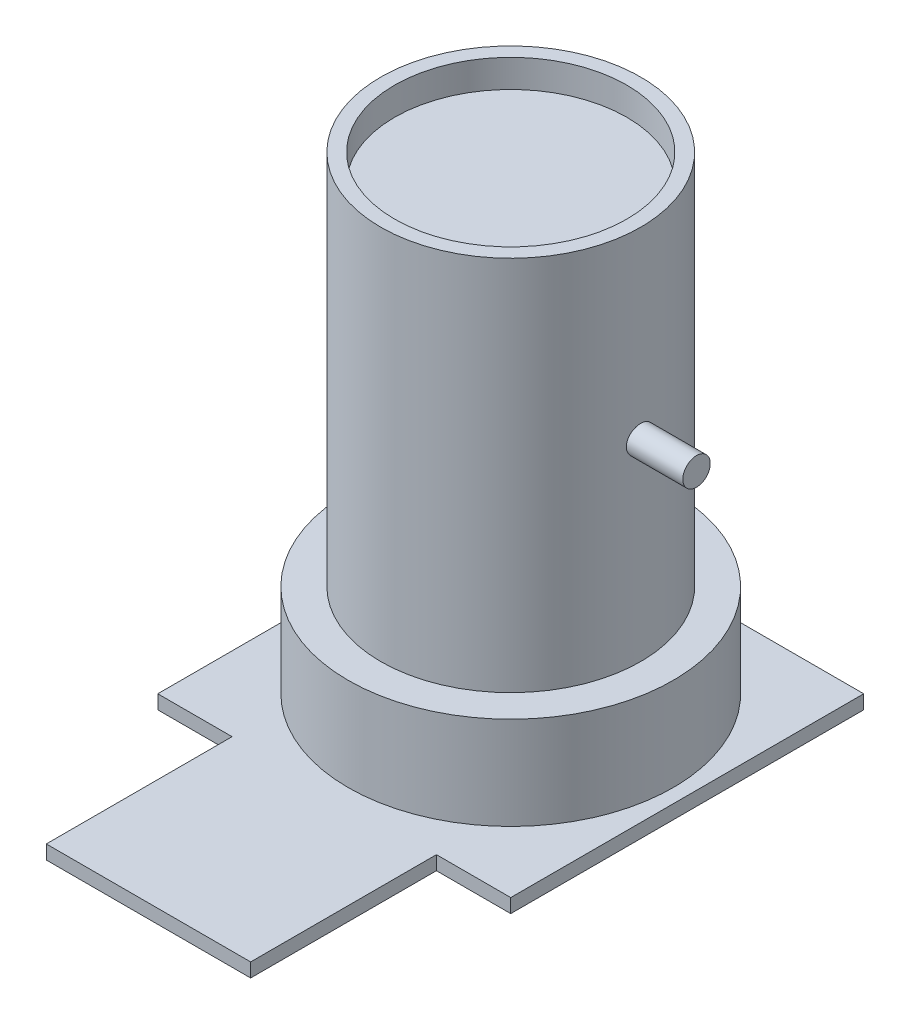
ISO-10303-21;
HEADER;
FILE_DESCRIPTION(('STEP AP214'),'2;1');
FILE_NAME('part.step','',(''),(''),'','','');
FILE_SCHEMA(('AUTOMOTIVE_DESIGN { 1 0 10303 214 1 1 1 1 }'));
ENDSEC;
DATA;
#1=APPLICATION_CONTEXT('core data for automotive mechanical design processes');
#2=APPLICATION_PROTOCOL_DEFINITION('international standard','automotive_design',2000,#1);
#3=PRODUCT_CONTEXT('',#1,'mechanical');
#4=PRODUCT('Part','Part','',(#3));
#5=PRODUCT_RELATED_PRODUCT_CATEGORY('part','',(#4));
#6=PRODUCT_DEFINITION_FORMATION('','',#4);
#7=PRODUCT_DEFINITION_CONTEXT('part definition',#1,'design');
#8=PRODUCT_DEFINITION('design','',#6,#7);
#9=PRODUCT_DEFINITION_SHAPE('','',#8);
#10=(LENGTH_UNIT() NAMED_UNIT(*) SI_UNIT(.MILLI.,.METRE.));
#11=(NAMED_UNIT(*) PLANE_ANGLE_UNIT() SI_UNIT($,.RADIAN.));
#12=(NAMED_UNIT(*) SI_UNIT($,.STERADIAN.) SOLID_ANGLE_UNIT());
#13=UNCERTAINTY_MEASURE_WITH_UNIT(LENGTH_MEASURE(1.E-05),#10,'distance_accuracy_value','');
#14=(GEOMETRIC_REPRESENTATION_CONTEXT(3) GLOBAL_UNCERTAINTY_ASSIGNED_CONTEXT((#13)) GLOBAL_UNIT_ASSIGNED_CONTEXT((#10,
#11,#12)) REPRESENTATION_CONTEXT('',''));
#15=CARTESIAN_POINT('',(0.,0.,0.));
#16=DIRECTION('',(0.,0.,1.));
#17=DIRECTION('',(1.,0.,0.));
#18=AXIS2_PLACEMENT_3D('',#15,#16,#17);
#19=CARTESIAN_POINT('',(-19.,1.5,19.));
#20=DIRECTION('',(0.,0.,-1.));
#21=DIRECTION('',(-1.,0.,0.));
#22=AXIS2_PLACEMENT_3D('',#19,#20,#21);
#23=PLANE('',#22);
#24=DIRECTION('',(0.,1.,0.));
#25=VECTOR('',#24,1.);
#26=CARTESIAN_POINT('',(11.,0.,19.));
#27=LINE('',#26,#25);
#28=CARTESIAN_POINT('',(11.,0.,19.));
#29=VERTEX_POINT('',#28);
#30=CARTESIAN_POINT('',(11.,1.5,19.));
#31=VERTEX_POINT('',#30);
#32=EDGE_CURVE('E128',#29,#31,#27,.T.);
#33=ORIENTED_EDGE('',*,*,#32,.F.);
#34=DIRECTION('',(1.,0.,0.));
#35=VECTOR('',#34,1.);
#36=CARTESIAN_POINT('',(-19.,0.,19.));
#37=LINE('',#36,#35);
#38=CARTESIAN_POINT('',(19.,0.,19.));
#39=VERTEX_POINT('',#38);
#40=EDGE_CURVE('E171',#29,#39,#37,.T.);
#41=ORIENTED_EDGE('',*,*,#40,.T.);
#42=DIRECTION('',(0.,-1.,0.));
#43=VECTOR('',#42,1.);
#44=CARTESIAN_POINT('',(19.,1.5,19.));
#45=LINE('',#44,#43);
#46=CARTESIAN_POINT('',(19.,1.5,19.));
#47=VERTEX_POINT('',#46);
#48=EDGE_CURVE('E182',#47,#39,#45,.T.);
#49=ORIENTED_EDGE('',*,*,#48,.F.);
#50=DIRECTION('',(1.,0.,0.));
#51=VECTOR('',#50,1.);
#52=CARTESIAN_POINT('',(-19.,1.5,19.));
#53=LINE('',#52,#51);
#54=EDGE_CURVE('E59',#31,#47,#53,.T.);
#55=ORIENTED_EDGE('',*,*,#54,.F.);
#56=EDGE_LOOP('',(#33,#41,#49,#55));
#57=FACE_BOUND('',#56,.T.);
#58=ADVANCED_FACE('F39',(#57),#23,.F.);
#59=DIRECTION('',(0.,-1.,0.));
#60=VECTOR('',#59,1.);
#61=CARTESIAN_POINT('',(-11.,1.5,19.));
#62=LINE('',#61,#60);
#63=CARTESIAN_POINT('',(-11.,1.5,19.));
#64=VERTEX_POINT('',#63);
#65=CARTESIAN_POINT('',(-11.,0.,19.));
#66=VERTEX_POINT('',#65);
#67=EDGE_CURVE('E67',#64,#66,#62,.T.);
#68=ORIENTED_EDGE('',*,*,#67,.F.);
#69=CARTESIAN_POINT('',(-19.,1.5,19.));
#70=VERTEX_POINT('',#69);
#71=EDGE_CURVE('E132',#70,#64,#53,.T.);
#72=ORIENTED_EDGE('',*,*,#71,.F.);
#73=DIRECTION('',(0.,-1.,0.));
#74=VECTOR('',#73,1.);
#75=CARTESIAN_POINT('',(-19.,1.5,19.));
#76=LINE('',#75,#74);
#77=CARTESIAN_POINT('',(-19.,0.,19.));
#78=VERTEX_POINT('',#77);
#79=EDGE_CURVE('E159',#70,#78,#76,.T.);
#80=ORIENTED_EDGE('',*,*,#79,.T.);
#81=EDGE_CURVE('E172',#78,#66,#37,.T.);
#82=ORIENTED_EDGE('',*,*,#81,.T.);
#83=EDGE_LOOP('',(#68,#72,#80,#82));
#84=FACE_BOUND('',#83,.T.);
#85=ADVANCED_FACE('F186',(#84),#23,.F.);
#86=CARTESIAN_POINT('',(0.,52.,0.));
#87=DIRECTION('',(0.,-1.,0.));
#88=DIRECTION('',(0.,0.,-1.));
#89=AXIS2_PLACEMENT_3D('',#86,#87,#88);
#90=CYLINDRICAL_SURFACE('',#89,14.);
#91=CARTESIAN_POINT('',(0.,52.,0.));
#92=DIRECTION('',(0.,1.,0.));
#93=DIRECTION('',(0.,0.,1.));
#94=AXIS2_PLACEMENT_3D('',#91,#92,#93);
#95=CIRCLE('',#94,14.);
#96=CARTESIAN_POINT('',(0.,52.,14.));
#97=VERTEX_POINT('',#96);
#98=EDGE_CURVE('E145',#97,#97,#95,.T.);
#99=ORIENTED_EDGE('',*,*,#98,.F.);
#100=EDGE_LOOP('',(#99));
#101=FACE_BOUND('',#100,.T.);
#102=CARTESIAN_POINT('',(0.,11.5,0.));
#103=DIRECTION('',(0.,1.,0.));
#104=DIRECTION('',(0.,0.,1.));
#105=AXIS2_PLACEMENT_3D('',#102,#103,#104);
#106=CIRCLE('',#105,14.);
#107=CARTESIAN_POINT('',(0.,11.5,14.));
#108=VERTEX_POINT('',#107);
#109=EDGE_CURVE('E52',#108,#108,#106,.T.);
#110=ORIENTED_EDGE('',*,*,#109,.T.);
#111=EDGE_LOOP('',(#110));
#112=FACE_BOUND('',#111,.T.);
#113=CARTESIAN_POINT('',(13.9217008769303,32.23,1.47859551374899));
#114=CARTESIAN_POINT('',(13.9217018985333,32.1471955140011,1.47859193940249));
#115=CARTESIAN_POINT('',(13.9224476075702,32.0643368916052,1.4716162374133));
#116=CARTESIAN_POINT('',(13.9253493119721,31.9009187118346,1.44389517206571));
#117=CARTESIAN_POINT('',(13.9275068449657,31.8203617611778,1.42313479534767));
#118=CARTESIAN_POINT('',(13.9329851479591,31.6639370236322,1.36845720880594));
#119=CARTESIAN_POINT('',(13.9363051953401,31.588066358135,1.33454817078543));
#120=CARTESIAN_POINT('',(13.9437335564317,31.4431091007587,1.25455190521855));
#121=CARTESIAN_POINT('',(13.9478417180394,31.3740212037164,1.20846702691307));
#122=CARTESIAN_POINT('',(13.9564020053146,31.2442956930374,1.10522746584132));
#123=CARTESIAN_POINT('',(13.9608553145534,31.1836893543187,1.04803357882295));
#124=CARTESIAN_POINT('',(13.9695934011982,31.0729168471415,0.924283470158432));
#125=CARTESIAN_POINT('',(13.9738781707509,31.022751164713,0.857726812901252));
#126=CARTESIAN_POINT('',(13.9818081976128,30.9341748963009,0.716947650328693));
#127=CARTESIAN_POINT('',(13.9854519322873,30.8957921412732,0.642707541101972));
#128=CARTESIAN_POINT('',(13.9916764280569,30.8320493599285,0.488790894859693));
#129=CARTESIAN_POINT('',(13.9942572178311,30.8066889822521,0.409114504587226));
#130=CARTESIAN_POINT('',(13.9980567239599,30.7698029860691,0.246904018121317));
#131=CARTESIAN_POINT('',(13.999280512265,30.7582258390939,0.164381759977712));
#132=CARTESIAN_POINT('',(14.000245393181,30.7490754457037,-0.00144290525880824));
#133=CARTESIAN_POINT('',(13.9999865283288,30.7515017975313,-0.0847452899016081));
#134=CARTESIAN_POINT('',(13.998019411168,30.7702478080579,-0.249415598561515));
#135=CARTESIAN_POINT('',(13.9963169394906,30.786512056579,-0.330789909166303));
#136=CARTESIAN_POINT('',(13.9916605266013,30.8323857955469,-0.489647387931168));
#137=CARTESIAN_POINT('',(13.9887065675378,30.8619954763584,-0.567130500568084));
#138=CARTESIAN_POINT('',(13.9818692906832,30.9337799470774,-0.716180142049843));
#139=CARTESIAN_POINT('',(13.9779841704686,30.9759791454358,-0.78773482939633));
#140=CARTESIAN_POINT('',(13.9697202552734,31.0717270419416,-0.922767241554956));
#141=CARTESIAN_POINT('',(13.9653414441348,31.12527611161,-0.986244701862365));
#142=CARTESIAN_POINT('',(13.9565560383355,31.2425150566284,-1.10364551962732));
#143=CARTESIAN_POINT('',(13.9521494123836,31.3062531526523,-1.157520732097));
#144=CARTESIAN_POINT('',(13.9438263087167,31.4418939917819,-1.25381470164222));
#145=CARTESIAN_POINT('',(13.9399098318543,31.5137967490896,-1.29623343878943));
#146=CARTESIAN_POINT('',(13.9330102070991,31.6637640641068,-1.36841072235792));
#147=CARTESIAN_POINT('',(13.9300272918413,31.7418301516029,-1.39816611385224));
#148=CARTESIAN_POINT('',(13.9253372837148,31.9018890149424,-1.44413302137016));
#149=CARTESIAN_POINT('',(13.923630147383,31.9838816569148,-1.46034499879226));
#150=CARTESIAN_POINT('',(13.9216926079778,32.1490429748327,-1.47870257419887));
#151=CARTESIAN_POINT('',(13.9214551253006,32.2322040755093,-1.48091560892356));
#152=CARTESIAN_POINT('',(13.9224650919054,32.3977130281326,-1.47138975316376));
#153=CARTESIAN_POINT('',(13.923712518761,32.4800608923427,-1.45965107339046));
#154=CARTESIAN_POINT('',(13.9275453067833,32.6414081191883,-1.42261150248023));
#155=CARTESIAN_POINT('',(13.9301275062476,32.7204149195407,-1.39734265546863));
#156=CARTESIAN_POINT('',(13.9363363273414,32.8730688048298,-1.33399280904767));
#157=CARTESIAN_POINT('',(13.9399629755594,32.9467157532606,-1.29591148346587));
#158=CARTESIAN_POINT('',(13.9478691653757,33.0868662815459,-1.20784937795188));
#159=CARTESIAN_POINT('',(13.9521511315215,33.1533417033728,-1.15782400570731));
#160=CARTESIAN_POINT('',(13.9608776219888,33.2769762819127,-1.04735757638407));
#161=CARTESIAN_POINT('',(13.9653221508002,33.3341351810633,-0.986916231442819));
#162=CARTESIAN_POINT('',(13.9738944318918,33.4377476302954,-0.857040586998218));
#163=CARTESIAN_POINT('',(13.9780208357538,33.4841571213642,-0.787571036541403));
#164=CARTESIAN_POINT('',(13.9854721985383,33.5646498334921,-0.64178452580534));
#165=CARTESIAN_POINT('',(13.9887971695356,33.5987332402651,-0.565467668714376));
#166=CARTESIAN_POINT('',(13.9942649663394,33.6535320151324,-0.408305171643969));
#167=CARTESIAN_POINT('',(13.996410123193,33.6742737572059,-0.327468812043141));
#168=CARTESIAN_POINT('',(13.9992861806915,33.701886442769,-0.163436943909355));
#169=CARTESIAN_POINT('',(14.000017125999,33.7087578243036,-0.0802415099633438));
#170=CARTESIAN_POINT('',(13.9999823418746,33.7084281655288,0.0857146703553778));
#171=CARTESIAN_POINT('',(13.9992238765688,33.7012954258923,0.168475562368818));
#172=CARTESIAN_POINT('',(13.9963098424257,33.6733035146444,0.331616218145153));
#173=CARTESIAN_POINT('',(13.9941542728547,33.6524443358244,0.411995980657554));
#174=CARTESIAN_POINT('',(13.9886874466702,33.597611125071,0.568090392235254));
#175=CARTESIAN_POINT('',(13.9853763899462,33.563639361397,0.64380584552323));
#176=CARTESIAN_POINT('',(13.9779671692675,33.4835525102341,0.788471010563124));
#177=CARTESIAN_POINT('',(13.9738690070023,33.437437448812,0.857420736837956));
#178=CARTESIAN_POINT('',(13.9653204471035,33.3341174639087,0.986947125080946));
#179=CARTESIAN_POINT('',(13.96086849095,33.2768616560894,1.04748309617783));
#180=CARTESIAN_POINT('',(13.9521271696985,33.1529874548082,1.15811733303848));
#181=CARTESIAN_POINT('',(13.9478378437544,33.0863668246708,1.20821309816758));
#182=CARTESIAN_POINT('',(13.9398945787594,32.9454469236806,1.296658232284));
#183=CARTESIAN_POINT('',(13.9362424556348,32.8711266393256,1.3349742599775));
#184=CARTESIAN_POINT('',(13.9300086305885,32.7171146306921,1.39853089550581));
#185=CARTESIAN_POINT('',(13.9274257307745,32.6374290344321,1.42378614379081));
#186=CARTESIAN_POINT('',(13.9242692380361,32.5027498604284,1.45425767524857));
#187=CARTESIAN_POINT('',(13.9233107063122,32.4486151435146,1.46337176006621));
#188=CARTESIAN_POINT('',(13.9220261889744,32.3396615313724,1.47554184836805));
#189=CARTESIAN_POINT('',(13.9217002003074,32.2848426394476,1.4785978810917));
#190=CARTESIAN_POINT('',(13.9217008769303,32.23,1.47859551374899));
#191=B_SPLINE_CURVE_WITH_KNOTS('',3,(#113,#114,#115,#116,#117,#118,#119,#120,#121,#122,#123,
#124,#125,#126,#127,#128,#129,#130,#131,#132,#133,#134,#135,#136,#137,#138,#139,#140,#141,#142,
#143,#144,#145,#146,#147,#148,#149,#150,#151,#152,#153,#154,#155,#156,#157,#158,#159,#160,#161,
#162,#163,#164,#165,#166,#167,#168,#169,#170,#171,#172,#173,#174,#175,#176,#177,#178,#179,#180,
#181,#182,#183,#184,#185,#186,#187,#188,#189,#190),.UNSPECIFIED.,.T.,.F.,(4,2,2,2,2,2,2,2,2,2,2,
2,2,2,2,2,2,2,2,2,2,2,2,2,2,2,2,2,2,2,2,2,2,2,2,2,2,2,4),(0.,0.24821316798498,0.496697117806667,
0.74502688343023,0.993308770556095,1.2424833214035,1.49166946914996,1.74143973796592,
1.99120326732686,2.24003009646647,2.48884978685416,2.73667780882406,2.98450936602609,
3.23282457456578,3.48114791258522,3.73068329520707,3.98021911188831,4.22981706120632,
4.47940650684763,4.72779269030607,4.97617512246302,5.22397188413062,5.47177495453797,
5.72051806049395,5.96926804197887,6.21902022176484,6.46876863844027,6.71802181939899,
6.96726712847783,7.21529984179486,7.46333268536854,7.71132264259443,7.9593120674879,
8.20846193895971,8.45767141831351,8.70757989913342,8.95720763508596,9.12160369184957,
9.28599895514642),.UNSPECIFIED.);
#192=CARTESIAN_POINT('',(13.9217008769303,32.23,1.47859551374899));
#193=VERTEX_POINT('',#192);
#194=EDGE_CURVE('E11',#193,#193,#191,.T.);
#195=ORIENTED_EDGE('',*,*,#194,.F.);
#196=EDGE_LOOP('',(#195));
#197=FACE_BOUND('',#196,.T.);
#198=ADVANCED_FACE('F229',(#101,#112,#197),#90,.T.);
#199=CARTESIAN_POINT('',(-19.,1.5,-19.));
#200=DIRECTION('',(1.,0.,0.));
#201=DIRECTION('',(0.,0.,-1.));
#202=AXIS2_PLACEMENT_3D('',#199,#200,#201);
#203=PLANE('',#202);
#204=DIRECTION('',(0.,0.,1.));
#205=VECTOR('',#204,1.);
#206=CARTESIAN_POINT('',(-19.,0.,-19.));
#207=LINE('',#206,#205);
#208=CARTESIAN_POINT('',(-19.,0.,-19.));
#209=VERTEX_POINT('',#208);
#210=EDGE_CURVE('E156',#209,#78,#207,.T.);
#211=ORIENTED_EDGE('',*,*,#210,.T.);
#212=ORIENTED_EDGE('',*,*,#79,.F.);
#213=DIRECTION('',(0.,0.,1.));
#214=VECTOR('',#213,1.);
#215=CARTESIAN_POINT('',(-19.,1.5,-19.));
#216=LINE('',#215,#214);
#217=CARTESIAN_POINT('',(-19.,1.5,-19.));
#218=VERTEX_POINT('',#217);
#219=EDGE_CURVE('E160',#218,#70,#216,.T.);
#220=ORIENTED_EDGE('',*,*,#219,.F.);
#221=DIRECTION('',(0.,-1.,0.));
#222=VECTOR('',#221,1.);
#223=CARTESIAN_POINT('',(-19.,1.5,-19.));
#224=LINE('',#223,#222);
#225=EDGE_CURVE('E168',#218,#209,#224,.T.);
#226=ORIENTED_EDGE('',*,*,#225,.T.);
#227=EDGE_LOOP('',(#211,#212,#220,#226));
#228=FACE_BOUND('',#227,.T.);
#229=ADVANCED_FACE('F41',(#228),#203,.F.);
#230=CARTESIAN_POINT('',(19.,1.5,-19.));
#231=DIRECTION('',(-1.,0.,0.));
#232=DIRECTION('',(0.,0.,1.));
#233=AXIS2_PLACEMENT_3D('',#230,#231,#232);
#234=PLANE('',#233);
#235=DIRECTION('',(0.,0.,-1.));
#236=VECTOR('',#235,1.);
#237=CARTESIAN_POINT('',(19.,0.,-19.));
#238=LINE('',#237,#236);
#239=CARTESIAN_POINT('',(19.,0.,-19.));
#240=VERTEX_POINT('',#239);
#241=EDGE_CURVE('E174',#39,#240,#238,.T.);
#242=ORIENTED_EDGE('',*,*,#241,.T.);
#243=DIRECTION('',(0.,-1.,0.));
#244=VECTOR('',#243,1.);
#245=CARTESIAN_POINT('',(19.,1.5,-19.));
#246=LINE('',#245,#244);
#247=CARTESIAN_POINT('',(19.,1.5,-19.));
#248=VERTEX_POINT('',#247);
#249=EDGE_CURVE('E179',#248,#240,#246,.T.);
#250=ORIENTED_EDGE('',*,*,#249,.F.);
#251=DIRECTION('',(0.,0.,-1.));
#252=VECTOR('',#251,1.);
#253=CARTESIAN_POINT('',(19.,1.5,-19.));
#254=LINE('',#253,#252);
#255=EDGE_CURVE('E164',#47,#248,#254,.T.);
#256=ORIENTED_EDGE('',*,*,#255,.F.);
#257=ORIENTED_EDGE('',*,*,#48,.T.);
#258=EDGE_LOOP('',(#242,#250,#256,#257));
#259=FACE_BOUND('',#258,.T.);
#260=ADVANCED_FACE('F209',(#259),#234,.F.);
#261=CARTESIAN_POINT('',(-19.,1.5,-19.));
#262=DIRECTION('',(0.,0.,1.));
#263=DIRECTION('',(1.,0.,0.));
#264=AXIS2_PLACEMENT_3D('',#261,#262,#263);
#265=PLANE('',#264);
#266=DIRECTION('',(-1.,0.,0.));
#267=VECTOR('',#266,1.);
#268=CARTESIAN_POINT('',(-19.,0.,-19.));
#269=LINE('',#268,#267);
#270=EDGE_CURVE('E162',#240,#209,#269,.T.);
#271=ORIENTED_EDGE('',*,*,#270,.T.);
#272=ORIENTED_EDGE('',*,*,#225,.F.);
#273=DIRECTION('',(-1.,0.,0.));
#274=VECTOR('',#273,1.);
#275=CARTESIAN_POINT('',(-19.,1.5,-19.));
#276=LINE('',#275,#274);
#277=EDGE_CURVE('E166',#248,#218,#276,.T.);
#278=ORIENTED_EDGE('',*,*,#277,.F.);
#279=ORIENTED_EDGE('',*,*,#249,.T.);
#280=EDGE_LOOP('',(#271,#272,#278,#279));
#281=FACE_BOUND('',#280,.T.);
#282=ADVANCED_FACE('F212',(#281),#265,.F.);
#283=CARTESIAN_POINT('',(0.,1.5,0.));
#284=DIRECTION('',(0.,1.,0.));
#285=DIRECTION('',(0.,0.,1.));
#286=AXIS2_PLACEMENT_3D('',#283,#284,#285);
#287=PLANE('',#286);
#288=CARTESIAN_POINT('',(0.,1.5,0.));
#289=DIRECTION('',(0.,1.,0.));
#290=DIRECTION('',(0.,0.,1.));
#291=AXIS2_PLACEMENT_3D('',#288,#289,#290);
#292=CIRCLE('',#291,17.5);
#293=CARTESIAN_POINT('',(0.,1.5,17.5));
#294=VERTEX_POINT('',#293);
#295=EDGE_CURVE('E153',#294,#294,#292,.T.);
#296=ORIENTED_EDGE('',*,*,#295,.F.);
#297=EDGE_LOOP('',(#296));
#298=FACE_BOUND('',#297,.T.);
#299=ORIENTED_EDGE('',*,*,#219,.T.);
#300=ORIENTED_EDGE('',*,*,#71,.T.);
#301=DIRECTION('',(0.,0.,-1.));
#302=VECTOR('',#301,1.);
#303=CARTESIAN_POINT('',(-11.,1.5,39.));
#304=LINE('',#303,#302);
#305=CARTESIAN_POINT('',(-11.,1.5,39.));
#306=VERTEX_POINT('',#305);
#307=EDGE_CURVE('E113',#306,#64,#304,.T.);
#308=ORIENTED_EDGE('',*,*,#307,.F.);
#309=DIRECTION('',(-1.,0.,0.));
#310=VECTOR('',#309,1.);
#311=CARTESIAN_POINT('',(11.,1.5,39.));
#312=LINE('',#311,#310);
#313=CARTESIAN_POINT('',(11.,1.5,39.));
#314=VERTEX_POINT('',#313);
#315=EDGE_CURVE('E119',#314,#306,#312,.T.);
#316=ORIENTED_EDGE('',*,*,#315,.F.);
#317=DIRECTION('',(0.,0.,-1.));
#318=VECTOR('',#317,1.);
#319=CARTESIAN_POINT('',(11.,1.5,39.));
#320=LINE('',#319,#318);
#321=EDGE_CURVE('E199',#314,#31,#320,.T.);
#322=ORIENTED_EDGE('',*,*,#321,.T.);
#323=ORIENTED_EDGE('',*,*,#54,.T.);
#324=ORIENTED_EDGE('',*,*,#255,.T.);
#325=ORIENTED_EDGE('',*,*,#277,.T.);
#326=EDGE_LOOP('',(#299,#300,#308,#316,#322,#323,#324,#325));
#327=FACE_BOUND('',#326,.T.);
#328=ADVANCED_FACE('F131',(#298,#327),#287,.T.);
#329=CARTESIAN_POINT('',(0.,0.,0.));
#330=DIRECTION('',(0.,1.,0.));
#331=DIRECTION('',(0.,0.,1.));
#332=AXIS2_PLACEMENT_3D('',#329,#330,#331);
#333=PLANE('',#332);
#334=ORIENTED_EDGE('',*,*,#210,.F.);
#335=ORIENTED_EDGE('',*,*,#270,.F.);
#336=ORIENTED_EDGE('',*,*,#241,.F.);
#337=ORIENTED_EDGE('',*,*,#40,.F.);
#338=DIRECTION('',(0.,0.,-1.));
#339=VECTOR('',#338,1.);
#340=CARTESIAN_POINT('',(11.,0.,39.));
#341=LINE('',#340,#339);
#342=CARTESIAN_POINT('',(11.,0.,39.));
#343=VERTEX_POINT('',#342);
#344=EDGE_CURVE('E138',#343,#29,#341,.T.);
#345=ORIENTED_EDGE('',*,*,#344,.F.);
#346=DIRECTION('',(1.,0.,0.));
#347=VECTOR('',#346,1.);
#348=CARTESIAN_POINT('',(-11.,0.,39.));
#349=LINE('',#348,#347);
#350=CARTESIAN_POINT('',(-11.,0.,39.));
#351=VERTEX_POINT('',#350);
#352=EDGE_CURVE('E118',#351,#343,#349,.T.);
#353=ORIENTED_EDGE('',*,*,#352,.F.);
#354=DIRECTION('',(0.,0.,-1.));
#355=VECTOR('',#354,1.);
#356=CARTESIAN_POINT('',(-11.,0.,39.));
#357=LINE('',#356,#355);
#358=EDGE_CURVE('E115',#351,#66,#357,.T.);
#359=ORIENTED_EDGE('',*,*,#358,.T.);
#360=ORIENTED_EDGE('',*,*,#81,.F.);
#361=EDGE_LOOP('',(#334,#335,#336,#337,#345,#353,#359,#360));
#362=FACE_BOUND('',#361,.T.);
#363=ADVANCED_FACE('F193',(#362),#333,.F.);
#364=CARTESIAN_POINT('',(0.,11.5,0.));
#365=DIRECTION('',(0.,-1.,0.));
#366=DIRECTION('',(0.,0.,-1.));
#367=AXIS2_PLACEMENT_3D('',#364,#365,#366);
#368=CYLINDRICAL_SURFACE('',#367,17.5);
#369=CARTESIAN_POINT('',(0.,11.5,0.));
#370=DIRECTION('',(0.,1.,0.));
#371=DIRECTION('',(0.,0.,1.));
#372=AXIS2_PLACEMENT_3D('',#369,#370,#371);
#373=CIRCLE('',#372,17.5);
#374=CARTESIAN_POINT('',(0.,11.5,17.5));
#375=VERTEX_POINT('',#374);
#376=EDGE_CURVE('E150',#375,#375,#373,.T.);
#377=ORIENTED_EDGE('',*,*,#376,.F.);
#378=EDGE_LOOP('',(#377));
#379=FACE_BOUND('',#378,.T.);
#380=ORIENTED_EDGE('',*,*,#295,.T.);
#381=EDGE_LOOP('',(#380));
#382=FACE_BOUND('',#381,.T.);
#383=ADVANCED_FACE('F249',(#379,#382),#368,.T.);
#384=CARTESIAN_POINT('',(0.,11.5,0.));
#385=DIRECTION('',(0.,1.,0.));
#386=DIRECTION('',(0.,0.,1.));
#387=AXIS2_PLACEMENT_3D('',#384,#385,#386);
#388=PLANE('',#387);
#389=ORIENTED_EDGE('',*,*,#109,.F.);
#390=EDGE_LOOP('',(#389));
#391=FACE_BOUND('',#390,.T.);
#392=ORIENTED_EDGE('',*,*,#376,.T.);
#393=EDGE_LOOP('',(#392));
#394=FACE_BOUND('',#393,.T.);
#395=ADVANCED_FACE('F246',(#391,#394),#388,.T.);
#396=CARTESIAN_POINT('',(0.,52.,0.));
#397=DIRECTION('',(0.,1.,0.));
#398=DIRECTION('',(0.,0.,1.));
#399=AXIS2_PLACEMENT_3D('',#396,#397,#398);
#400=PLANE('',#399);
#401=CARTESIAN_POINT('',(0.,52.,0.));
#402=DIRECTION('',(0.,1.,0.));
#403=DIRECTION('',(0.,0.,1.));
#404=AXIS2_PLACEMENT_3D('',#401,#402,#403);
#405=CIRCLE('',#404,12.5);
#406=CARTESIAN_POINT('',(0.,52.,12.5));
#407=VERTEX_POINT('',#406);
#408=EDGE_CURVE('E136',#407,#407,#405,.T.);
#409=ORIENTED_EDGE('',*,*,#408,.F.);
#410=EDGE_LOOP('',(#409));
#411=FACE_BOUND('',#410,.T.);
#412=ORIENTED_EDGE('',*,*,#98,.T.);
#413=EDGE_LOOP('',(#412));
#414=FACE_BOUND('',#413,.T.);
#415=ADVANCED_FACE('F244',(#411,#414),#400,.T.);
#416=CARTESIAN_POINT('',(0.,49.,0.));
#417=DIRECTION('',(0.,1.,0.));
#418=DIRECTION('',(0.,0.,1.));
#419=AXIS2_PLACEMENT_3D('',#416,#417,#418);
#420=CYLINDRICAL_SURFACE('',#419,12.5);
#421=CARTESIAN_POINT('',(0.,49.,0.));
#422=DIRECTION('',(0.,1.,0.));
#423=DIRECTION('',(0.,0.,1.));
#424=AXIS2_PLACEMENT_3D('',#421,#422,#423);
#425=CIRCLE('',#424,12.5);
#426=CARTESIAN_POINT('',(0.,49.,12.5));
#427=VERTEX_POINT('',#426);
#428=EDGE_CURVE('E142',#427,#427,#425,.T.);
#429=ORIENTED_EDGE('',*,*,#428,.F.);
#430=EDGE_LOOP('',(#429));
#431=FACE_BOUND('',#430,.T.);
#432=ORIENTED_EDGE('',*,*,#408,.T.);
#433=EDGE_LOOP('',(#432));
#434=FACE_BOUND('',#433,.T.);
#435=ADVANCED_FACE('F316',(#431,#434),#420,.F.);
#436=CARTESIAN_POINT('',(0.,49.,0.));
#437=DIRECTION('',(0.,1.,0.));
#438=DIRECTION('',(0.,0.,1.));
#439=AXIS2_PLACEMENT_3D('',#436,#437,#438);
#440=PLANE('',#439);
#441=ORIENTED_EDGE('',*,*,#428,.T.);
#442=EDGE_LOOP('',(#441));
#443=FACE_BOUND('',#442,.T.);
#444=ADVANCED_FACE('F304',(#443),#440,.T.);
#445=CARTESIAN_POINT('',(20.,32.23,0.));
#446=DIRECTION('',(-1.,0.,0.));
#447=DIRECTION('',(0.,0.,1.));
#448=AXIS2_PLACEMENT_3D('',#445,#446,#447);
#449=CYLINDRICAL_SURFACE('',#448,1.47859551374899);
#450=CARTESIAN_POINT('',(20.,32.23,0.));
#451=DIRECTION('',(1.,0.,0.));
#452=DIRECTION('',(0.,0.,-1.));
#453=AXIS2_PLACEMENT_3D('',#450,#451,#452);
#454=CIRCLE('',#453,1.47859551374899);
#455=CARTESIAN_POINT('',(20.,32.23,-1.47859551374899));
#456=VERTEX_POINT('',#455);
#457=EDGE_CURVE('E133',#456,#456,#454,.T.);
#458=ORIENTED_EDGE('',*,*,#457,.F.);
#459=EDGE_LOOP('',(#458));
#460=FACE_BOUND('',#459,.T.);
#461=ORIENTED_EDGE('',*,*,#194,.T.);
#462=EDGE_LOOP('',(#461));
#463=FACE_BOUND('',#462,.T.);
#464=ADVANCED_FACE('F297',(#460,#463),#449,.T.);
#465=CARTESIAN_POINT('',(20.,32.23,0.));
#466=DIRECTION('',(1.,0.,0.));
#467=DIRECTION('',(0.,0.,-1.));
#468=AXIS2_PLACEMENT_3D('',#465,#466,#467);
#469=PLANE('',#468);
#470=ORIENTED_EDGE('',*,*,#457,.T.);
#471=EDGE_LOOP('',(#470));
#472=FACE_BOUND('',#471,.T.);
#473=ADVANCED_FACE('F264',(#472),#469,.T.);
#474=CARTESIAN_POINT('',(-11.,1.5,39.));
#475=DIRECTION('',(1.,0.,0.));
#476=DIRECTION('',(0.,0.,-1.));
#477=AXIS2_PLACEMENT_3D('',#474,#475,#476);
#478=PLANE('',#477);
#479=ORIENTED_EDGE('',*,*,#67,.T.);
#480=ORIENTED_EDGE('',*,*,#358,.F.);
#481=DIRECTION('',(0.,-1.,0.));
#482=VECTOR('',#481,1.);
#483=CARTESIAN_POINT('',(-11.,1.5,39.));
#484=LINE('',#483,#482);
#485=EDGE_CURVE('E109',#306,#351,#484,.T.);
#486=ORIENTED_EDGE('',*,*,#485,.F.);
#487=ORIENTED_EDGE('',*,*,#307,.T.);
#488=EDGE_LOOP('',(#479,#480,#486,#487));
#489=FACE_BOUND('',#488,.T.);
#490=ADVANCED_FACE('F111',(#489),#478,.F.);
#491=CARTESIAN_POINT('',(11.,0.,39.));
#492=DIRECTION('',(-1.,0.,0.));
#493=DIRECTION('',(0.,0.,1.));
#494=AXIS2_PLACEMENT_3D('',#491,#492,#493);
#495=PLANE('',#494);
#496=ORIENTED_EDGE('',*,*,#32,.T.);
#497=ORIENTED_EDGE('',*,*,#321,.F.);
#498=DIRECTION('',(0.,1.,0.));
#499=VECTOR('',#498,1.);
#500=CARTESIAN_POINT('',(11.,0.,39.));
#501=LINE('',#500,#499);
#502=EDGE_CURVE('E124',#343,#314,#501,.T.);
#503=ORIENTED_EDGE('',*,*,#502,.F.);
#504=ORIENTED_EDGE('',*,*,#344,.T.);
#505=EDGE_LOOP('',(#496,#497,#503,#504));
#506=FACE_BOUND('',#505,.T.);
#507=ADVANCED_FACE('F205',(#506),#495,.F.);
#508=CARTESIAN_POINT('',(0.,0.,39.));
#509=DIRECTION('',(0.,0.,1.));
#510=DIRECTION('',(1.,0.,0.));
#511=AXIS2_PLACEMENT_3D('',#508,#509,#510);
#512=PLANE('',#511);
#513=ORIENTED_EDGE('',*,*,#315,.T.);
#514=ORIENTED_EDGE('',*,*,#485,.T.);
#515=ORIENTED_EDGE('',*,*,#352,.T.);
#516=ORIENTED_EDGE('',*,*,#502,.T.);
#517=EDGE_LOOP('',(#513,#514,#515,#516));
#518=FACE_BOUND('',#517,.T.);
#519=ADVANCED_FACE('F122',(#518),#512,.T.);
#520=CLOSED_SHELL('',(#58,#85,#198,#229,#260,#282,#328,#363,#383,#395,#415,#435,#444,#464,#473,
#490,#507,#519));
#521=MANIFOLD_SOLID_BREP('B2',#520);
#522=ADVANCED_BREP_SHAPE_REPRESENTATION('',(#18,#521),#14);
#523=SHAPE_DEFINITION_REPRESENTATION(#9,#522);
ENDSEC;
END-ISO-10303-21;
